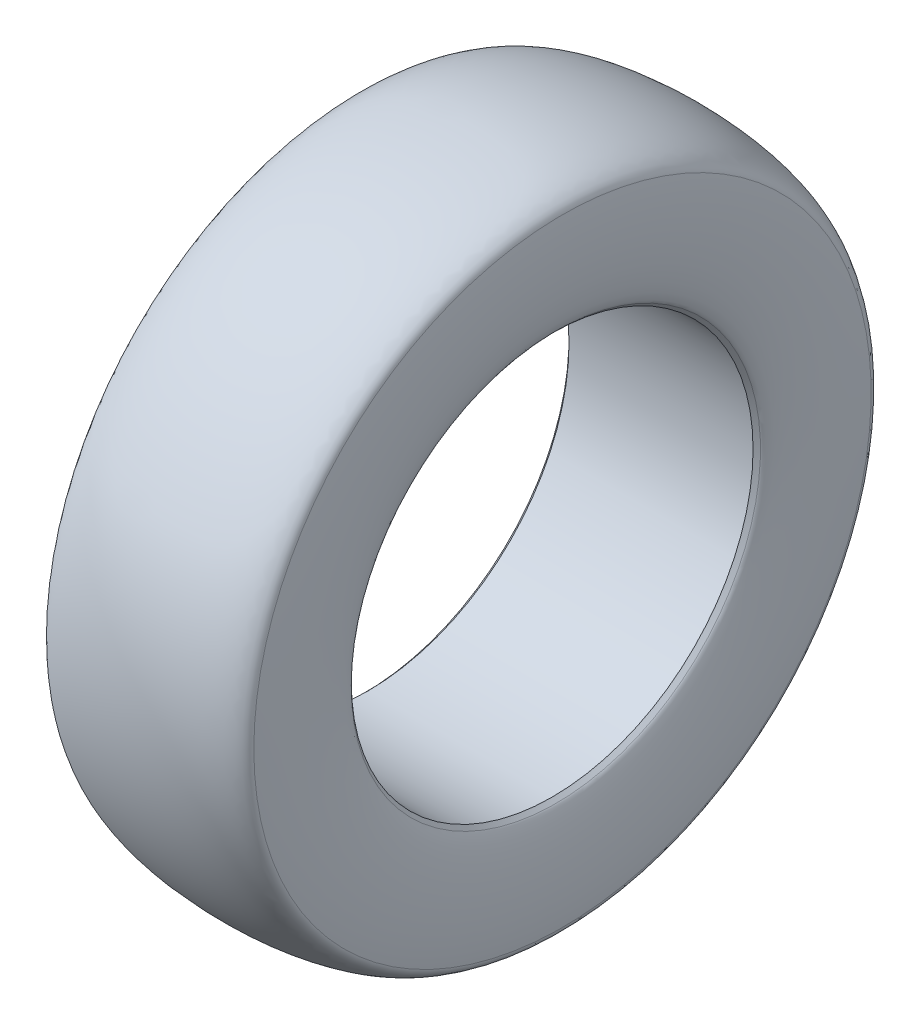
ISO-10303-21;
HEADER;
FILE_DESCRIPTION(('STEP AP214'),'2;1');
FILE_NAME('part.step','',(''),(''),'','','');
FILE_SCHEMA(('AUTOMOTIVE_DESIGN { 1 0 10303 214 1 1 1 1 }'));
ENDSEC;
DATA;
#1=APPLICATION_CONTEXT('core data for automotive mechanical design processes');
#2=APPLICATION_PROTOCOL_DEFINITION('international standard','automotive_design',2000,#1);
#3=PRODUCT_CONTEXT('',#1,'mechanical');
#4=PRODUCT('Part','Part','',(#3));
#5=PRODUCT_RELATED_PRODUCT_CATEGORY('part','',(#4));
#6=PRODUCT_DEFINITION_FORMATION('','',#4);
#7=PRODUCT_DEFINITION_CONTEXT('part definition',#1,'design');
#8=PRODUCT_DEFINITION('design','',#6,#7);
#9=PRODUCT_DEFINITION_SHAPE('','',#8);
#10=(LENGTH_UNIT() NAMED_UNIT(*) SI_UNIT(.MILLI.,.METRE.));
#11=(NAMED_UNIT(*) PLANE_ANGLE_UNIT() SI_UNIT($,.RADIAN.));
#12=(NAMED_UNIT(*) SI_UNIT($,.STERADIAN.) SOLID_ANGLE_UNIT());
#13=UNCERTAINTY_MEASURE_WITH_UNIT(LENGTH_MEASURE(1.E-05),#10,'distance_accuracy_value','');
#14=(GEOMETRIC_REPRESENTATION_CONTEXT(3) GLOBAL_UNCERTAINTY_ASSIGNED_CONTEXT((#13)) GLOBAL_UNIT_ASSIGNED_CONTEXT((#10,
#11,#12)) REPRESENTATION_CONTEXT('',''));
#15=CARTESIAN_POINT('',(0.,0.,0.));
#16=DIRECTION('',(0.,0.,1.));
#17=DIRECTION('',(1.,0.,0.));
#18=AXIS2_PLACEMENT_3D('',#15,#16,#17);
#19=CARTESIAN_POINT('',(-114.056846686133,325.886259272776,0.));
#20=DIRECTION('',(0.,0.,1.));
#21=DIRECTION('',(0.,-1.,0.));
#22=AXIS2_PLACEMENT_3D('',#19,#20,#21);
#23=ELLIPSE('',#22,78.6006106280388,12.943153313867);
#24=CARTESIAN_POINT('',(-1000.,0.,0.));
#25=DIRECTION('',(-1.,0.,0.));
#26=AXIS1_PLACEMENT('',#24,#25);
#27=SURFACE_OF_REVOLUTION('',#23,#26);
#28=CARTESIAN_POINT('',(-116.159871939465,0.,0.));
#29=DIRECTION('',(-1.,0.,0.));
#30=DIRECTION('',(0.,0.,1.));
#31=AXIS2_PLACEMENT_3D('',#28,#29,#30);
#32=CIRCLE('',#31,248.330128060535);
#33=CARTESIAN_POINT('',(-116.159871939465,0.,248.330128060535));
#34=VERTEX_POINT('',#33);
#35=EDGE_CURVE('E10',#34,#34,#32,.T.);
#36=ORIENTED_EDGE('',*,*,#35,.F.);
#37=EDGE_LOOP('',(#36));
#38=FACE_BOUND('',#37,.T.);
#39=CARTESIAN_POINT('',(-124.21699820195,0.,0.));
#40=DIRECTION('',(-1.,0.,0.));
#41=DIRECTION('',(0.,0.,1.));
#42=AXIS2_PLACEMENT_3D('',#39,#40,#41);
#43=CIRCLE('',#42,374.580726901316);
#44=CARTESIAN_POINT('',(-124.21699820195,0.,374.580726901316));
#45=VERTEX_POINT('',#44);
#46=EDGE_CURVE('E54',#45,#45,#43,.T.);
#47=ORIENTED_EDGE('',*,*,#46,.T.);
#48=EDGE_LOOP('',(#47));
#49=FACE_BOUND('',#48,.T.);
#50=ADVANCED_FACE('F31',(#38,#49),#27,.T.);
#51=CARTESIAN_POINT('',(-116.159871939465,0.,0.));
#52=DIRECTION('',(-1.,0.,0.));
#53=DIRECTION('',(0.,0.,1.));
#54=AXIS2_PLACEMENT_3D('',#51,#52,#53);
#55=CONICAL_SURFACE('',#54,248.330128060535,0.785398163397445);
#56=CARTESIAN_POINT('',(-111.669743878931,0.,0.));
#57=DIRECTION('',(-1.,0.,0.));
#58=DIRECTION('',(0.,0.,1.));
#59=AXIS2_PLACEMENT_3D('',#56,#57,#58);
#60=CIRCLE('',#59,243.84);
#61=CARTESIAN_POINT('',(-111.669743878931,0.,243.84));
#62=VERTEX_POINT('',#61);
#63=EDGE_CURVE('E38',#62,#62,#60,.T.);
#64=ORIENTED_EDGE('',*,*,#63,.F.);
#65=EDGE_LOOP('',(#64));
#66=FACE_BOUND('',#65,.T.);
#67=ORIENTED_EDGE('',*,*,#35,.T.);
#68=EDGE_LOOP('',(#67));
#69=FACE_BOUND('',#68,.T.);
#70=ADVANCED_FACE('F75',(#66,#69),#55,.F.);
#71=CARTESIAN_POINT('',(-1000.,0.,0.));
#72=DIRECTION('',(-1.,0.,0.));
#73=DIRECTION('',(0.,0.,1.));
#74=AXIS2_PLACEMENT_3D('',#71,#72,#73);
#75=CYLINDRICAL_SURFACE('',#74,243.84);
#76=CARTESIAN_POINT('',(111.669743878931,0.,0.));
#77=DIRECTION('',(-1.,0.,0.));
#78=DIRECTION('',(0.,0.,1.));
#79=AXIS2_PLACEMENT_3D('',#76,#77,#78);
#80=CIRCLE('',#79,243.84);
#81=CARTESIAN_POINT('',(111.669743878931,0.,243.84));
#82=VERTEX_POINT('',#81);
#83=EDGE_CURVE('E42',#82,#82,#80,.T.);
#84=ORIENTED_EDGE('',*,*,#83,.F.);
#85=EDGE_LOOP('',(#84));
#86=FACE_BOUND('',#85,.T.);
#87=ORIENTED_EDGE('',*,*,#63,.T.);
#88=EDGE_LOOP('',(#87));
#89=FACE_BOUND('',#88,.T.);
#90=ADVANCED_FACE('F72',(#86,#89),#75,.F.);
#91=CARTESIAN_POINT('',(111.669743878931,0.,0.));
#92=DIRECTION('',(1.,0.,0.));
#93=DIRECTION('',(0.,0.,-1.));
#94=AXIS2_PLACEMENT_3D('',#91,#92,#93);
#95=CONICAL_SURFACE('',#94,243.84,0.785398163397458);
#96=CARTESIAN_POINT('',(116.159871939465,0.,0.));
#97=DIRECTION('',(-1.,0.,0.));
#98=DIRECTION('',(0.,0.,1.));
#99=AXIS2_PLACEMENT_3D('',#96,#97,#98);
#100=CIRCLE('',#99,248.330128060535);
#101=CARTESIAN_POINT('',(116.159871939465,0.,248.330128060535));
#102=VERTEX_POINT('',#101);
#103=EDGE_CURVE('E46',#102,#102,#100,.T.);
#104=ORIENTED_EDGE('',*,*,#103,.F.);
#105=EDGE_LOOP('',(#104));
#106=FACE_BOUND('',#105,.T.);
#107=ORIENTED_EDGE('',*,*,#83,.T.);
#108=EDGE_LOOP('',(#107));
#109=FACE_BOUND('',#108,.T.);
#110=ADVANCED_FACE('F68',(#106,#109),#95,.F.);
#111=CARTESIAN_POINT('',(114.056846686133,325.886259272776,0.));
#112=DIRECTION('',(0.,0.,1.));
#113=DIRECTION('',(0.,-1.,0.));
#114=AXIS2_PLACEMENT_3D('',#111,#112,#113);
#115=ELLIPSE('',#114,78.6006106280388,12.943153313867);
#116=CARTESIAN_POINT('',(-1000.,0.,0.));
#117=DIRECTION('',(-1.,0.,0.));
#118=AXIS1_PLACEMENT('',#116,#117);
#119=SURFACE_OF_REVOLUTION('',#115,#118);
#120=CARTESIAN_POINT('',(124.21699820195,0.,0.));
#121=DIRECTION('',(-1.,0.,0.));
#122=DIRECTION('',(0.,0.,1.));
#123=AXIS2_PLACEMENT_3D('',#120,#121,#122);
#124=CIRCLE('',#123,374.580726901316);
#125=CARTESIAN_POINT('',(124.21699820195,0.,374.580726901316));
#126=VERTEX_POINT('',#125);
#127=EDGE_CURVE('E51',#126,#126,#124,.T.);
#128=ORIENTED_EDGE('',*,*,#127,.F.);
#129=EDGE_LOOP('',(#128));
#130=FACE_BOUND('',#129,.T.);
#131=ORIENTED_EDGE('',*,*,#103,.T.);
#132=EDGE_LOOP('',(#131));
#133=FACE_BOUND('',#132,.T.);
#134=ADVANCED_FACE('F64',(#130,#133),#119,.T.);
#135=CARTESIAN_POINT('',(0.,373.445897982817,0.));
#136=DIRECTION('',(0.,0.,1.));
#137=DIRECTION('',(-1.,0.,0.));
#138=AXIS2_PLACEMENT_3D('',#135,#136,#137);
#139=ELLIPSE('',#138,124.290717185098,32.9541020171825);
#140=CARTESIAN_POINT('',(-1000.,0.,0.));
#141=DIRECTION('',(-1.,0.,0.));
#142=AXIS1_PLACEMENT('',#140,#141);
#143=SURFACE_OF_REVOLUTION('',#139,#142);
#144=ORIENTED_EDGE('',*,*,#46,.F.);
#145=EDGE_LOOP('',(#144));
#146=FACE_BOUND('',#145,.T.);
#147=ORIENTED_EDGE('',*,*,#127,.T.);
#148=EDGE_LOOP('',(#147));
#149=FACE_BOUND('',#148,.T.);
#150=ADVANCED_FACE('F61',(#146,#149),#143,.T.);
#151=CLOSED_SHELL('',(#50,#70,#90,#110,#134,#150));
#152=MANIFOLD_SOLID_BREP('B2',#151);
#153=ADVANCED_BREP_SHAPE_REPRESENTATION('',(#18,#152),#14);
#154=SHAPE_DEFINITION_REPRESENTATION(#9,#153);
ENDSEC;
END-ISO-10303-21;
